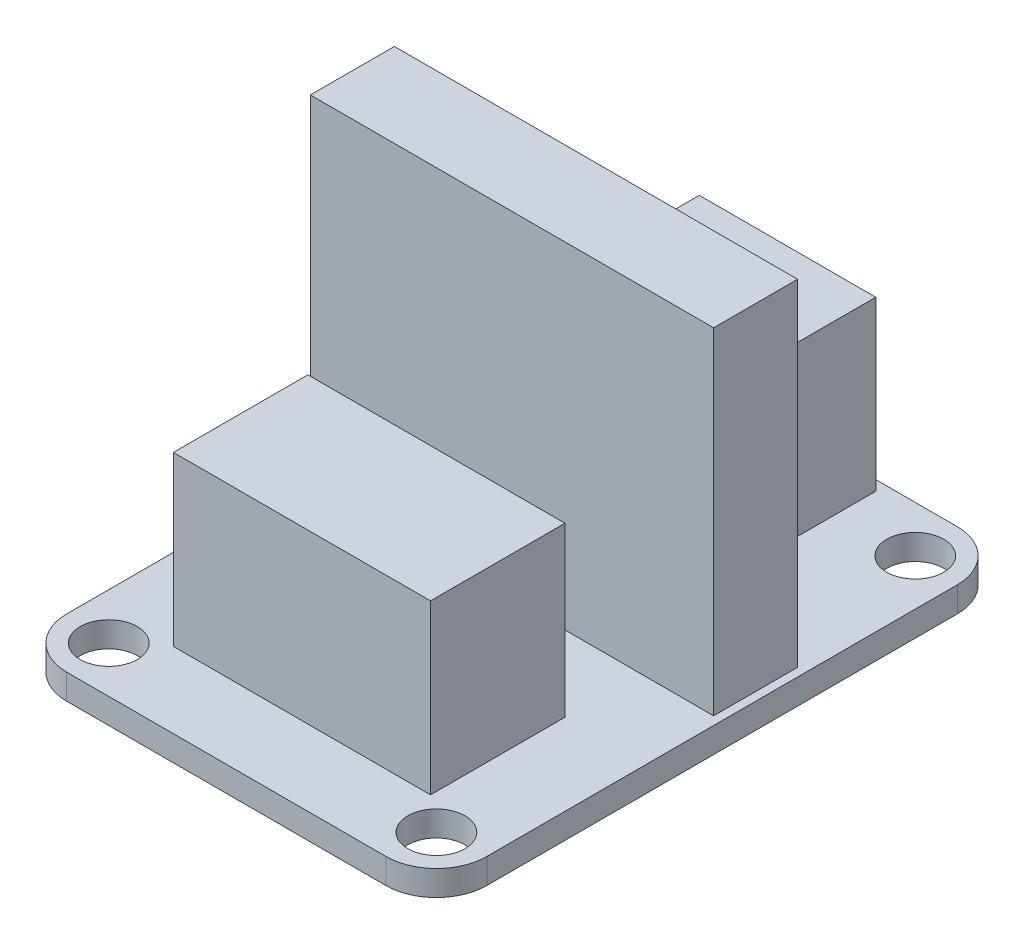
ISO-10303-21;
HEADER;
FILE_DESCRIPTION(('STEP AP214'),'2;1');
FILE_NAME('part.step','',(''),(''),'','','');
FILE_SCHEMA(('AUTOMOTIVE_DESIGN { 1 0 10303 214 1 1 1 1 }'));
ENDSEC;
DATA;
#1=APPLICATION_CONTEXT('core data for automotive mechanical design processes');
#2=APPLICATION_PROTOCOL_DEFINITION('international standard','automotive_design',2000,#1);
#3=PRODUCT_CONTEXT('',#1,'mechanical');
#4=PRODUCT('Part','Part','',(#3));
#5=PRODUCT_RELATED_PRODUCT_CATEGORY('part','',(#4));
#6=PRODUCT_DEFINITION_FORMATION('','',#4);
#7=PRODUCT_DEFINITION_CONTEXT('part definition',#1,'design');
#8=PRODUCT_DEFINITION('design','',#6,#7);
#9=PRODUCT_DEFINITION_SHAPE('','',#8);
#10=(LENGTH_UNIT() NAMED_UNIT(*) SI_UNIT(.MILLI.,.METRE.));
#11=(NAMED_UNIT(*) PLANE_ANGLE_UNIT() SI_UNIT($,.RADIAN.));
#12=(NAMED_UNIT(*) SI_UNIT($,.STERADIAN.) SOLID_ANGLE_UNIT());
#13=UNCERTAINTY_MEASURE_WITH_UNIT(LENGTH_MEASURE(1.E-05),#10,'distance_accuracy_value','');
#14=(GEOMETRIC_REPRESENTATION_CONTEXT(3) GLOBAL_UNCERTAINTY_ASSIGNED_CONTEXT((#13)) GLOBAL_UNIT_ASSIGNED_CONTEXT((#10,
#11,#12)) REPRESENTATION_CONTEXT('',''));
#15=CARTESIAN_POINT('',(0.,0.,0.));
#16=DIRECTION('',(0.,0.,1.));
#17=DIRECTION('',(1.,0.,0.));
#18=AXIS2_PLACEMENT_3D('',#15,#16,#17);
#19=CARTESIAN_POINT('',(0.,1.5,0.));
#20=DIRECTION('',(0.,-1.,0.));
#21=DIRECTION('',(0.,0.,-1.));
#22=AXIS2_PLACEMENT_3D('',#19,#20,#21);
#23=PLANE('',#22);
#24=DIRECTION('',(0.,0.,1.));
#25=VECTOR('',#24,1.);
#26=CARTESIAN_POINT('',(-5.25,1.5,-8.4));
#27=LINE('',#26,#25);
#28=CARTESIAN_POINT('',(-5.25,1.5,-16.4));
#29=VERTEX_POINT('',#28);
#30=CARTESIAN_POINT('',(-5.25,1.5,-8.4));
#31=VERTEX_POINT('',#30);
#32=EDGE_CURVE('E203',#29,#31,#27,.T.);
#33=ORIENTED_EDGE('',*,*,#32,.F.);
#34=DIRECTION('',(-1.,0.,0.));
#35=VECTOR('',#34,1.);
#36=CARTESIAN_POINT('',(5.25,1.5,-16.4));
#37=LINE('',#36,#35);
#38=CARTESIAN_POINT('',(5.25,1.5,-16.4));
#39=VERTEX_POINT('',#38);
#40=EDGE_CURVE('E219',#39,#29,#37,.T.);
#41=ORIENTED_EDGE('',*,*,#40,.F.);
#42=DIRECTION('',(0.,0.,-1.));
#43=VECTOR('',#42,1.);
#44=CARTESIAN_POINT('',(5.25,1.5,-8.4));
#45=LINE('',#44,#43);
#46=CARTESIAN_POINT('',(5.25,1.5,-8.4));
#47=VERTEX_POINT('',#46);
#48=EDGE_CURVE('E232',#47,#39,#45,.T.);
#49=ORIENTED_EDGE('',*,*,#48,.F.);
#50=DIRECTION('',(1.,0.,0.));
#51=VECTOR('',#50,1.);
#52=CARTESIAN_POINT('',(5.25,1.5,-8.4));
#53=LINE('',#52,#51);
#54=EDGE_CURVE('E208',#31,#47,#53,.T.);
#55=ORIENTED_EDGE('',*,*,#54,.F.);
#56=EDGE_LOOP('',(#33,#41,#49,#55));
#57=FACE_BOUND('',#56,.T.);
#58=DIRECTION('',(0.,0.,1.));
#59=VECTOR('',#58,1.);
#60=CARTESIAN_POINT('',(-12.5,1.5,17.));
#61=LINE('',#60,#59);
#62=CARTESIAN_POINT('',(-12.5,1.5,-14.));
#63=VERTEX_POINT('',#62);
#64=CARTESIAN_POINT('',(-12.5,1.5,14.));
#65=VERTEX_POINT('',#64);
#66=EDGE_CURVE('E341',#63,#65,#61,.T.);
#67=ORIENTED_EDGE('',*,*,#66,.T.);
#68=CARTESIAN_POINT('',(-9.5,1.5,14.));
#69=DIRECTION('',(0.,-1.,0.));
#70=DIRECTION('',(0.,0.,-1.));
#71=AXIS2_PLACEMENT_3D('',#68,#69,#70);
#72=CIRCLE('',#71,3.);
#73=CARTESIAN_POINT('',(-9.5,1.5,17.));
#74=VERTEX_POINT('',#73);
#75=EDGE_CURVE('E398',#65,#74,#72,.F.);
#76=ORIENTED_EDGE('',*,*,#75,.T.);
#77=DIRECTION('',(1.,0.,0.));
#78=VECTOR('',#77,1.);
#79=CARTESIAN_POINT('',(-12.5,1.5,17.));
#80=LINE('',#79,#78);
#81=CARTESIAN_POINT('',(9.5,1.5,17.));
#82=VERTEX_POINT('',#81);
#83=EDGE_CURVE('E345',#74,#82,#80,.T.);
#84=ORIENTED_EDGE('',*,*,#83,.T.);
#85=CARTESIAN_POINT('',(9.5,1.5,14.));
#86=DIRECTION('',(0.,-1.,0.));
#87=DIRECTION('',(0.,0.,-1.));
#88=AXIS2_PLACEMENT_3D('',#85,#86,#87);
#89=CIRCLE('',#88,3.);
#90=CARTESIAN_POINT('',(12.5,1.5,14.));
#91=VERTEX_POINT('',#90);
#92=EDGE_CURVE('E389',#82,#91,#89,.F.);
#93=ORIENTED_EDGE('',*,*,#92,.T.);
#94=DIRECTION('',(0.,0.,-1.));
#95=VECTOR('',#94,1.);
#96=CARTESIAN_POINT('',(12.5,1.5,17.));
#97=LINE('',#96,#95);
#98=CARTESIAN_POINT('',(12.5,1.5,-14.));
#99=VERTEX_POINT('',#98);
#100=EDGE_CURVE('E332',#91,#99,#97,.T.);
#101=ORIENTED_EDGE('',*,*,#100,.T.);
#102=CARTESIAN_POINT('',(9.5,1.5,-14.));
#103=DIRECTION('',(0.,-1.,0.));
#104=DIRECTION('',(0.,0.,-1.));
#105=AXIS2_PLACEMENT_3D('',#102,#103,#104);
#106=CIRCLE('',#105,3.);
#107=CARTESIAN_POINT('',(9.5,1.5,-17.));
#108=VERTEX_POINT('',#107);
#109=EDGE_CURVE('E392',#99,#108,#106,.F.);
#110=ORIENTED_EDGE('',*,*,#109,.T.);
#111=DIRECTION('',(-1.,0.,0.));
#112=VECTOR('',#111,1.);
#113=CARTESIAN_POINT('',(-12.5,1.5,-17.));
#114=LINE('',#113,#112);
#115=CARTESIAN_POINT('',(-9.5,1.5,-17.));
#116=VERTEX_POINT('',#115);
#117=EDGE_CURVE('E336',#108,#116,#114,.T.);
#118=ORIENTED_EDGE('',*,*,#117,.T.);
#119=CARTESIAN_POINT('',(-9.5,1.5,-14.));
#120=DIRECTION('',(0.,-1.,0.));
#121=DIRECTION('',(0.,0.,-1.));
#122=AXIS2_PLACEMENT_3D('',#119,#120,#121);
#123=CIRCLE('',#122,3.);
#124=EDGE_CURVE('E395',#116,#63,#123,.F.);
#125=ORIENTED_EDGE('',*,*,#124,.T.);
#126=EDGE_LOOP('',(#67,#76,#84,#93,#101,#110,#118,#125));
#127=FACE_BOUND('',#126,.T.);
#128=CARTESIAN_POINT('',(-9.75,1.5,14.25));
#129=DIRECTION('',(0.,1.,0.));
#130=DIRECTION('',(0.,0.,1.));
#131=AXIS2_PLACEMENT_3D('',#128,#129,#130);
#132=CIRCLE('',#131,1.69999999999999);
#133=CARTESIAN_POINT('',(-9.75,1.5,15.95));
#134=VERTEX_POINT('',#133);
#135=EDGE_CURVE('E323',#134,#134,#132,.T.);
#136=ORIENTED_EDGE('',*,*,#135,.F.);
#137=EDGE_LOOP('',(#136));
#138=FACE_BOUND('',#137,.T.);
#139=CARTESIAN_POINT('',(9.75,1.5,14.25));
#140=DIRECTION('',(0.,1.,0.));
#141=DIRECTION('',(0.,0.,1.));
#142=AXIS2_PLACEMENT_3D('',#139,#140,#141);
#143=CIRCLE('',#142,1.69999999999999);
#144=CARTESIAN_POINT('',(9.75,1.5,15.95));
#145=VERTEX_POINT('',#144);
#146=EDGE_CURVE('E315',#145,#145,#143,.T.);
#147=ORIENTED_EDGE('',*,*,#146,.F.);
#148=EDGE_LOOP('',(#147));
#149=FACE_BOUND('',#148,.T.);
#150=CARTESIAN_POINT('',(9.75,1.5,-14.25));
#151=DIRECTION('',(0.,1.,0.));
#152=DIRECTION('',(0.,0.,1.));
#153=AXIS2_PLACEMENT_3D('',#150,#151,#152);
#154=CIRCLE('',#153,1.69999999999999);
#155=CARTESIAN_POINT('',(9.75,1.5,-12.55));
#156=VERTEX_POINT('',#155);
#157=EDGE_CURVE('E307',#156,#156,#154,.T.);
#158=ORIENTED_EDGE('',*,*,#157,.F.);
#159=EDGE_LOOP('',(#158));
#160=FACE_BOUND('',#159,.T.);
#161=CARTESIAN_POINT('',(-9.75,1.5,-14.25));
#162=DIRECTION('',(0.,1.,0.));
#163=DIRECTION('',(0.,0.,1.));
#164=AXIS2_PLACEMENT_3D('',#161,#162,#163);
#165=CIRCLE('',#164,1.69999999999999);
#166=CARTESIAN_POINT('',(-9.75,1.5,-12.55));
#167=VERTEX_POINT('',#166);
#168=EDGE_CURVE('E299',#167,#167,#165,.T.);
#169=ORIENTED_EDGE('',*,*,#168,.F.);
#170=EDGE_LOOP('',(#169));
#171=FACE_BOUND('',#170,.T.);
#172=DIRECTION('',(0.,0.,1.));
#173=VECTOR('',#172,1.);
#174=CARTESIAN_POINT('',(-12.,1.5,0.));
#175=LINE('',#174,#173);
#176=CARTESIAN_POINT('',(-12.,1.5,-4.99999999999999));
#177=VERTEX_POINT('',#176);
#178=CARTESIAN_POINT('',(-12.,1.5,0.));
#179=VERTEX_POINT('',#178);
#180=EDGE_CURVE('E254',#177,#179,#175,.T.);
#181=ORIENTED_EDGE('',*,*,#180,.F.);
#182=DIRECTION('',(-1.,0.,0.));
#183=VECTOR('',#182,1.);
#184=CARTESIAN_POINT('',(12.,1.5,-5.));
#185=LINE('',#184,#183);
#186=CARTESIAN_POINT('',(12.,1.5,-5.));
#187=VERTEX_POINT('',#186);
#188=EDGE_CURVE('E260',#187,#177,#185,.T.);
#189=ORIENTED_EDGE('',*,*,#188,.F.);
#190=DIRECTION('',(0.,0.,-1.));
#191=VECTOR('',#190,1.);
#192=CARTESIAN_POINT('',(12.,1.5,0.));
#193=LINE('',#192,#191);
#194=CARTESIAN_POINT('',(12.,1.5,0.));
#195=VERTEX_POINT('',#194);
#196=EDGE_CURVE('E277',#195,#187,#193,.T.);
#197=ORIENTED_EDGE('',*,*,#196,.F.);
#198=DIRECTION('',(1.,0.,0.));
#199=VECTOR('',#198,1.);
#200=CARTESIAN_POINT('',(12.,1.5,0.));
#201=LINE('',#200,#199);
#202=EDGE_CURVE('E273',#179,#195,#201,.T.);
#203=ORIENTED_EDGE('',*,*,#202,.F.);
#204=EDGE_LOOP('',(#181,#189,#197,#203));
#205=FACE_BOUND('',#204,.T.);
#206=DIRECTION('',(0.,0.,1.));
#207=VECTOR('',#206,1.);
#208=CARTESIAN_POINT('',(-7.65,1.5,12.5));
#209=LINE('',#208,#207);
#210=CARTESIAN_POINT('',(-7.65,1.5,4.5));
#211=VERTEX_POINT('',#210);
#212=CARTESIAN_POINT('',(-7.65,1.5,12.5));
#213=VERTEX_POINT('',#212);
#214=EDGE_CURVE('E201',#211,#213,#209,.T.);
#215=ORIENTED_EDGE('',*,*,#214,.F.);
#216=DIRECTION('',(-1.,0.,0.));
#217=VECTOR('',#216,1.);
#218=CARTESIAN_POINT('',(7.65,1.5,4.5));
#219=LINE('',#218,#217);
#220=CARTESIAN_POINT('',(7.65,1.5,4.5));
#221=VERTEX_POINT('',#220);
#222=EDGE_CURVE('E198',#221,#211,#219,.T.);
#223=ORIENTED_EDGE('',*,*,#222,.F.);
#224=DIRECTION('',(0.,0.,-1.));
#225=VECTOR('',#224,1.);
#226=CARTESIAN_POINT('',(7.65,1.5,12.5));
#227=LINE('',#226,#225);
#228=CARTESIAN_POINT('',(7.65,1.5,12.5));
#229=VERTEX_POINT('',#228);
#230=EDGE_CURVE('E62',#229,#221,#227,.T.);
#231=ORIENTED_EDGE('',*,*,#230,.F.);
#232=DIRECTION('',(1.,0.,0.));
#233=VECTOR('',#232,1.);
#234=CARTESIAN_POINT('',(7.65,1.5,12.5));
#235=LINE('',#234,#233);
#236=EDGE_CURVE('E57',#213,#229,#235,.T.);
#237=ORIENTED_EDGE('',*,*,#236,.F.);
#238=EDGE_LOOP('',(#215,#223,#231,#237));
#239=FACE_BOUND('',#238,.T.);
#240=ADVANCED_FACE('F41',(#57,#127,#138,#149,#160,#171,#205,#239),#23,.F.);
#241=CARTESIAN_POINT('',(12.5,1.5,17.));
#242=DIRECTION('',(-1.,0.,0.));
#243=DIRECTION('',(0.,0.,1.));
#244=AXIS2_PLACEMENT_3D('',#241,#242,#243);
#245=PLANE('',#244);
#246=DIRECTION('',(0.,0.,-1.));
#247=VECTOR('',#246,1.);
#248=CARTESIAN_POINT('',(12.5,0.,17.));
#249=LINE('',#248,#247);
#250=CARTESIAN_POINT('',(12.5,0.,14.));
#251=VERTEX_POINT('',#250);
#252=CARTESIAN_POINT('',(12.5,0.,-14.));
#253=VERTEX_POINT('',#252);
#254=EDGE_CURVE('E331',#251,#253,#249,.T.);
#255=ORIENTED_EDGE('',*,*,#254,.T.);
#256=DIRECTION('',(0.,-1.,0.));
#257=VECTOR('',#256,1.);
#258=CARTESIAN_POINT('',(12.5,1.5,-14.));
#259=LINE('',#258,#257);
#260=EDGE_CURVE('E11',#253,#99,#259,.F.);
#261=ORIENTED_EDGE('',*,*,#260,.T.);
#262=ORIENTED_EDGE('',*,*,#100,.F.);
#263=DIRECTION('',(0.,-1.,0.));
#264=VECTOR('',#263,1.);
#265=CARTESIAN_POINT('',(12.5,1.5,14.));
#266=LINE('',#265,#264);
#267=EDGE_CURVE('E50',#91,#251,#266,.T.);
#268=ORIENTED_EDGE('',*,*,#267,.T.);
#269=EDGE_LOOP('',(#255,#261,#262,#268));
#270=FACE_BOUND('',#269,.T.);
#271=ADVANCED_FACE('F413',(#270),#245,.F.);
#272=CARTESIAN_POINT('',(-12.5,1.5,-17.));
#273=DIRECTION('',(0.,0.,1.));
#274=DIRECTION('',(1.,0.,0.));
#275=AXIS2_PLACEMENT_3D('',#272,#273,#274);
#276=PLANE('',#275);
#277=DIRECTION('',(-1.,0.,0.));
#278=VECTOR('',#277,1.);
#279=CARTESIAN_POINT('',(-12.5,0.,-17.));
#280=LINE('',#279,#278);
#281=CARTESIAN_POINT('',(9.5,0.,-17.));
#282=VERTEX_POINT('',#281);
#283=CARTESIAN_POINT('',(-9.5,0.,-17.));
#284=VERTEX_POINT('',#283);
#285=EDGE_CURVE('E353',#282,#284,#280,.T.);
#286=ORIENTED_EDGE('',*,*,#285,.T.);
#287=DIRECTION('',(0.,-1.,0.));
#288=VECTOR('',#287,1.);
#289=CARTESIAN_POINT('',(-9.5,1.5,-17.));
#290=LINE('',#289,#288);
#291=EDGE_CURVE('E405',#284,#116,#290,.F.);
#292=ORIENTED_EDGE('',*,*,#291,.T.);
#293=ORIENTED_EDGE('',*,*,#117,.F.);
#294=DIRECTION('',(0.,-1.,0.));
#295=VECTOR('',#294,1.);
#296=CARTESIAN_POINT('',(9.5,1.5,-17.));
#297=LINE('',#296,#295);
#298=EDGE_CURVE('E401',#108,#282,#297,.T.);
#299=ORIENTED_EDGE('',*,*,#298,.T.);
#300=EDGE_LOOP('',(#286,#292,#293,#299));
#301=FACE_BOUND('',#300,.T.);
#302=ADVANCED_FACE('F427',(#301),#276,.F.);
#303=CARTESIAN_POINT('',(-12.5,1.5,17.));
#304=DIRECTION('',(1.,0.,0.));
#305=DIRECTION('',(0.,0.,-1.));
#306=AXIS2_PLACEMENT_3D('',#303,#304,#305);
#307=PLANE('',#306);
#308=DIRECTION('',(0.,0.,1.));
#309=VECTOR('',#308,1.);
#310=CARTESIAN_POINT('',(-12.5,0.,17.));
#311=LINE('',#310,#309);
#312=CARTESIAN_POINT('',(-12.5,0.,-14.));
#313=VERTEX_POINT('',#312);
#314=CARTESIAN_POINT('',(-12.5,0.,14.));
#315=VERTEX_POINT('',#314);
#316=EDGE_CURVE('E357',#313,#315,#311,.T.);
#317=ORIENTED_EDGE('',*,*,#316,.T.);
#318=DIRECTION('',(0.,-1.,0.));
#319=VECTOR('',#318,1.);
#320=CARTESIAN_POINT('',(-12.5,1.5,14.));
#321=LINE('',#320,#319);
#322=EDGE_CURVE('E386',#315,#65,#321,.F.);
#323=ORIENTED_EDGE('',*,*,#322,.T.);
#324=ORIENTED_EDGE('',*,*,#66,.F.);
#325=DIRECTION('',(0.,-1.,0.));
#326=VECTOR('',#325,1.);
#327=CARTESIAN_POINT('',(-12.5,1.5,-14.));
#328=LINE('',#327,#326);
#329=EDGE_CURVE('E382',#63,#313,#328,.T.);
#330=ORIENTED_EDGE('',*,*,#329,.T.);
#331=EDGE_LOOP('',(#317,#323,#324,#330));
#332=FACE_BOUND('',#331,.T.);
#333=ADVANCED_FACE('F438',(#332),#307,.F.);
#334=CARTESIAN_POINT('',(-12.5,1.5,17.));
#335=DIRECTION('',(0.,0.,-1.));
#336=DIRECTION('',(-1.,0.,0.));
#337=AXIS2_PLACEMENT_3D('',#334,#335,#336);
#338=PLANE('',#337);
#339=ORIENTED_EDGE('',*,*,#83,.F.);
#340=DIRECTION('',(0.,-1.,0.));
#341=VECTOR('',#340,1.);
#342=CARTESIAN_POINT('',(-9.5,1.5,17.));
#343=LINE('',#342,#341);
#344=CARTESIAN_POINT('',(-9.5,0.,17.));
#345=VERTEX_POINT('',#344);
#346=EDGE_CURVE('E366',#74,#345,#343,.T.);
#347=ORIENTED_EDGE('',*,*,#346,.T.);
#348=DIRECTION('',(1.,0.,0.));
#349=VECTOR('',#348,1.);
#350=CARTESIAN_POINT('',(-12.5,0.,17.));
#351=LINE('',#350,#349);
#352=CARTESIAN_POINT('',(9.5,0.,17.));
#353=VERTEX_POINT('',#352);
#354=EDGE_CURVE('E337',#345,#353,#351,.T.);
#355=ORIENTED_EDGE('',*,*,#354,.T.);
#356=DIRECTION('',(0.,-1.,0.));
#357=VECTOR('',#356,1.);
#358=CARTESIAN_POINT('',(9.5,1.5,17.));
#359=LINE('',#358,#357);
#360=EDGE_CURVE('E349',#353,#82,#359,.F.);
#361=ORIENTED_EDGE('',*,*,#360,.T.);
#362=EDGE_LOOP('',(#339,#347,#355,#361));
#363=FACE_BOUND('',#362,.T.);
#364=ADVANCED_FACE('F446',(#363),#338,.F.);
#365=CARTESIAN_POINT('',(0.,0.,0.));
#366=DIRECTION('',(0.,-1.,0.));
#367=DIRECTION('',(0.,0.,-1.));
#368=AXIS2_PLACEMENT_3D('',#365,#366,#367);
#369=PLANE('',#368);
#370=CARTESIAN_POINT('',(-9.75,0.,-14.25));
#371=DIRECTION('',(0.,1.,0.));
#372=DIRECTION('',(0.,0.,1.));
#373=AXIS2_PLACEMENT_3D('',#370,#371,#372);
#374=CIRCLE('',#373,1.7);
#375=CARTESIAN_POINT('',(-9.75,0.,-12.55));
#376=VERTEX_POINT('',#375);
#377=EDGE_CURVE('E303',#376,#376,#374,.T.);
#378=ORIENTED_EDGE('',*,*,#377,.T.);
#379=EDGE_LOOP('',(#378));
#380=FACE_BOUND('',#379,.T.);
#381=CARTESIAN_POINT('',(9.75,0.,-14.25));
#382=DIRECTION('',(0.,1.,0.));
#383=DIRECTION('',(0.,0.,1.));
#384=AXIS2_PLACEMENT_3D('',#381,#382,#383);
#385=CIRCLE('',#384,1.7);
#386=CARTESIAN_POINT('',(9.75,0.,-12.55));
#387=VERTEX_POINT('',#386);
#388=EDGE_CURVE('E311',#387,#387,#385,.T.);
#389=ORIENTED_EDGE('',*,*,#388,.T.);
#390=EDGE_LOOP('',(#389));
#391=FACE_BOUND('',#390,.T.);
#392=CARTESIAN_POINT('',(9.75,0.,14.25));
#393=DIRECTION('',(0.,1.,0.));
#394=DIRECTION('',(0.,0.,1.));
#395=AXIS2_PLACEMENT_3D('',#392,#393,#394);
#396=CIRCLE('',#395,1.7);
#397=CARTESIAN_POINT('',(9.75,0.,15.95));
#398=VERTEX_POINT('',#397);
#399=EDGE_CURVE('E319',#398,#398,#396,.T.);
#400=ORIENTED_EDGE('',*,*,#399,.T.);
#401=EDGE_LOOP('',(#400));
#402=FACE_BOUND('',#401,.T.);
#403=CARTESIAN_POINT('',(-9.75,0.,14.25));
#404=DIRECTION('',(0.,1.,0.));
#405=DIRECTION('',(0.,0.,1.));
#406=AXIS2_PLACEMENT_3D('',#403,#404,#405);
#407=CIRCLE('',#406,1.7);
#408=CARTESIAN_POINT('',(-9.75,0.,15.95));
#409=VERTEX_POINT('',#408);
#410=EDGE_CURVE('E327',#409,#409,#407,.T.);
#411=ORIENTED_EDGE('',*,*,#410,.T.);
#412=EDGE_LOOP('',(#411));
#413=FACE_BOUND('',#412,.T.);
#414=ORIENTED_EDGE('',*,*,#354,.F.);
#415=CARTESIAN_POINT('',(-9.5,0.,14.));
#416=DIRECTION('',(0.,-1.,0.));
#417=DIRECTION('',(0.,0.,-1.));
#418=AXIS2_PLACEMENT_3D('',#415,#416,#417);
#419=CIRCLE('',#418,3.);
#420=EDGE_CURVE('E379',#345,#315,#419,.T.);
#421=ORIENTED_EDGE('',*,*,#420,.T.);
#422=ORIENTED_EDGE('',*,*,#316,.F.);
#423=CARTESIAN_POINT('',(-9.5,0.,-14.));
#424=DIRECTION('',(0.,-1.,0.));
#425=DIRECTION('',(0.,0.,-1.));
#426=AXIS2_PLACEMENT_3D('',#423,#424,#425);
#427=CIRCLE('',#426,3.);
#428=EDGE_CURVE('E376',#313,#284,#427,.T.);
#429=ORIENTED_EDGE('',*,*,#428,.T.);
#430=ORIENTED_EDGE('',*,*,#285,.F.);
#431=CARTESIAN_POINT('',(9.5,0.,-14.));
#432=DIRECTION('',(0.,-1.,0.));
#433=DIRECTION('',(0.,0.,-1.));
#434=AXIS2_PLACEMENT_3D('',#431,#432,#433);
#435=CIRCLE('',#434,3.);
#436=EDGE_CURVE('E373',#282,#253,#435,.T.);
#437=ORIENTED_EDGE('',*,*,#436,.T.);
#438=ORIENTED_EDGE('',*,*,#254,.F.);
#439=CARTESIAN_POINT('',(9.5,0.,14.));
#440=DIRECTION('',(0.,-1.,0.));
#441=DIRECTION('',(0.,0.,-1.));
#442=AXIS2_PLACEMENT_3D('',#439,#440,#441);
#443=CIRCLE('',#442,3.);
#444=EDGE_CURVE('E370',#251,#353,#443,.T.);
#445=ORIENTED_EDGE('',*,*,#444,.T.);
#446=EDGE_LOOP('',(#414,#421,#422,#429,#430,#437,#438,#445));
#447=FACE_BOUND('',#446,.T.);
#448=ADVANCED_FACE('F419',(#380,#391,#402,#413,#447),#369,.T.);
#449=CARTESIAN_POINT('',(-9.5,1.5,14.));
#450=DIRECTION('',(0.,-1.,0.));
#451=DIRECTION('',(0.,0.,-1.));
#452=AXIS2_PLACEMENT_3D('',#449,#450,#451);
#453=CYLINDRICAL_SURFACE('',#452,3.);
#454=ORIENTED_EDGE('',*,*,#75,.F.);
#455=ORIENTED_EDGE('',*,*,#322,.F.);
#456=ORIENTED_EDGE('',*,*,#420,.F.);
#457=ORIENTED_EDGE('',*,*,#346,.F.);
#458=EDGE_LOOP('',(#454,#455,#456,#457));
#459=FACE_BOUND('',#458,.T.);
#460=ADVANCED_FACE('F443',(#459),#453,.T.);
#461=CARTESIAN_POINT('',(-9.5,1.5,-14.));
#462=DIRECTION('',(0.,-1.,0.));
#463=DIRECTION('',(0.,0.,-1.));
#464=AXIS2_PLACEMENT_3D('',#461,#462,#463);
#465=CYLINDRICAL_SURFACE('',#464,3.);
#466=ORIENTED_EDGE('',*,*,#124,.F.);
#467=ORIENTED_EDGE('',*,*,#291,.F.);
#468=ORIENTED_EDGE('',*,*,#428,.F.);
#469=ORIENTED_EDGE('',*,*,#329,.F.);
#470=EDGE_LOOP('',(#466,#467,#468,#469));
#471=FACE_BOUND('',#470,.T.);
#472=ADVANCED_FACE('F435',(#471),#465,.T.);
#473=CARTESIAN_POINT('',(9.5,1.5,-14.));
#474=DIRECTION('',(0.,-1.,0.));
#475=DIRECTION('',(0.,0.,-1.));
#476=AXIS2_PLACEMENT_3D('',#473,#474,#475);
#477=CYLINDRICAL_SURFACE('',#476,3.);
#478=ORIENTED_EDGE('',*,*,#109,.F.);
#479=ORIENTED_EDGE('',*,*,#260,.F.);
#480=ORIENTED_EDGE('',*,*,#436,.F.);
#481=ORIENTED_EDGE('',*,*,#298,.F.);
#482=EDGE_LOOP('',(#478,#479,#480,#481));
#483=FACE_BOUND('',#482,.T.);
#484=ADVANCED_FACE('F424',(#483),#477,.T.);
#485=CARTESIAN_POINT('',(9.5,1.5,14.));
#486=DIRECTION('',(0.,-1.,0.));
#487=DIRECTION('',(0.,0.,-1.));
#488=AXIS2_PLACEMENT_3D('',#485,#486,#487);
#489=CYLINDRICAL_SURFACE('',#488,3.);
#490=ORIENTED_EDGE('',*,*,#92,.F.);
#491=ORIENTED_EDGE('',*,*,#360,.F.);
#492=ORIENTED_EDGE('',*,*,#444,.F.);
#493=ORIENTED_EDGE('',*,*,#267,.F.);
#494=EDGE_LOOP('',(#490,#491,#492,#493));
#495=FACE_BOUND('',#494,.T.);
#496=ADVANCED_FACE('F43',(#495),#489,.T.);
#497=CARTESIAN_POINT('',(-9.75,1.5,14.25));
#498=DIRECTION('',(0.,1.,0.));
#499=DIRECTION('',(0.,0.,1.));
#500=AXIS2_PLACEMENT_3D('',#497,#498,#499);
#501=CYLINDRICAL_SURFACE('',#500,1.69999999999999);
#502=ORIENTED_EDGE('',*,*,#410,.F.);
#503=EDGE_LOOP('',(#502));
#504=FACE_BOUND('',#503,.T.);
#505=ORIENTED_EDGE('',*,*,#135,.T.);
#506=EDGE_LOOP('',(#505));
#507=FACE_BOUND('',#506,.T.);
#508=ADVANCED_FACE('F449',(#504,#507),#501,.F.);
#509=CARTESIAN_POINT('',(9.75,1.5,14.25));
#510=DIRECTION('',(0.,1.,0.));
#511=DIRECTION('',(0.,0.,1.));
#512=AXIS2_PLACEMENT_3D('',#509,#510,#511);
#513=CYLINDRICAL_SURFACE('',#512,1.69999999999999);
#514=ORIENTED_EDGE('',*,*,#399,.F.);
#515=EDGE_LOOP('',(#514));
#516=FACE_BOUND('',#515,.T.);
#517=ORIENTED_EDGE('',*,*,#146,.T.);
#518=EDGE_LOOP('',(#517));
#519=FACE_BOUND('',#518,.T.);
#520=ADVANCED_FACE('F454',(#516,#519),#513,.F.);
#521=CARTESIAN_POINT('',(9.75,1.5,-14.25));
#522=DIRECTION('',(0.,1.,0.));
#523=DIRECTION('',(0.,0.,1.));
#524=AXIS2_PLACEMENT_3D('',#521,#522,#523);
#525=CYLINDRICAL_SURFACE('',#524,1.69999999999999);
#526=ORIENTED_EDGE('',*,*,#388,.F.);
#527=EDGE_LOOP('',(#526));
#528=FACE_BOUND('',#527,.T.);
#529=ORIENTED_EDGE('',*,*,#157,.T.);
#530=EDGE_LOOP('',(#529));
#531=FACE_BOUND('',#530,.T.);
#532=ADVANCED_FACE('F513',(#528,#531),#525,.F.);
#533=CARTESIAN_POINT('',(-9.75,1.5,-14.25));
#534=DIRECTION('',(0.,1.,0.));
#535=DIRECTION('',(0.,0.,1.));
#536=AXIS2_PLACEMENT_3D('',#533,#534,#535);
#537=CYLINDRICAL_SURFACE('',#536,1.69999999999999);
#538=ORIENTED_EDGE('',*,*,#377,.F.);
#539=EDGE_LOOP('',(#538));
#540=FACE_BOUND('',#539,.T.);
#541=ORIENTED_EDGE('',*,*,#168,.T.);
#542=EDGE_LOOP('',(#541));
#543=FACE_BOUND('',#542,.T.);
#544=ADVANCED_FACE('F522',(#540,#543),#537,.F.);
#545=CARTESIAN_POINT('',(-12.,21.5,0.));
#546=DIRECTION('',(1.,0.,0.));
#547=DIRECTION('',(0.,0.,-1.));
#548=AXIS2_PLACEMENT_3D('',#545,#546,#547);
#549=PLANE('',#548);
#550=ORIENTED_EDGE('',*,*,#180,.T.);
#551=DIRECTION('',(0.,-1.,0.));
#552=VECTOR('',#551,1.);
#553=CARTESIAN_POINT('',(-12.,21.5,0.));
#554=LINE('',#553,#552);
#555=CARTESIAN_POINT('',(-12.,21.5,0.));
#556=VERTEX_POINT('',#555);
#557=EDGE_CURVE('E295',#556,#179,#554,.T.);
#558=ORIENTED_EDGE('',*,*,#557,.F.);
#559=DIRECTION('',(0.,0.,1.));
#560=VECTOR('',#559,1.);
#561=CARTESIAN_POINT('',(-12.,21.5,0.));
#562=LINE('',#561,#560);
#563=CARTESIAN_POINT('',(-12.,21.5,-4.99999999999999));
#564=VERTEX_POINT('',#563);
#565=EDGE_CURVE('E255',#564,#556,#562,.T.);
#566=ORIENTED_EDGE('',*,*,#565,.F.);
#567=DIRECTION('',(0.,-1.,0.));
#568=VECTOR('',#567,1.);
#569=CARTESIAN_POINT('',(-12.,21.5,-4.99999999999999));
#570=LINE('',#569,#568);
#571=EDGE_CURVE('E269',#564,#177,#570,.T.);
#572=ORIENTED_EDGE('',*,*,#571,.T.);
#573=EDGE_LOOP('',(#550,#558,#566,#572));
#574=FACE_BOUND('',#573,.T.);
#575=ADVANCED_FACE('F532',(#574),#549,.F.);
#576=CARTESIAN_POINT('',(12.,21.5,0.));
#577=DIRECTION('',(0.,0.,-1.));
#578=DIRECTION('',(-1.,0.,0.));
#579=AXIS2_PLACEMENT_3D('',#576,#577,#578);
#580=PLANE('',#579);
#581=ORIENTED_EDGE('',*,*,#202,.T.);
#582=DIRECTION('',(0.,-1.,0.));
#583=VECTOR('',#582,1.);
#584=CARTESIAN_POINT('',(12.,21.5,0.));
#585=LINE('',#584,#583);
#586=CARTESIAN_POINT('',(12.,21.5,0.));
#587=VERTEX_POINT('',#586);
#588=EDGE_CURVE('E291',#587,#195,#585,.T.);
#589=ORIENTED_EDGE('',*,*,#588,.F.);
#590=DIRECTION('',(1.,0.,0.));
#591=VECTOR('',#590,1.);
#592=CARTESIAN_POINT('',(12.,21.5,0.));
#593=LINE('',#592,#591);
#594=EDGE_CURVE('E259',#556,#587,#593,.T.);
#595=ORIENTED_EDGE('',*,*,#594,.F.);
#596=ORIENTED_EDGE('',*,*,#557,.T.);
#597=EDGE_LOOP('',(#581,#589,#595,#596));
#598=FACE_BOUND('',#597,.T.);
#599=ADVANCED_FACE('F542',(#598),#580,.F.);
#600=CARTESIAN_POINT('',(12.,21.5,0.));
#601=DIRECTION('',(-1.,0.,0.));
#602=DIRECTION('',(0.,0.,1.));
#603=AXIS2_PLACEMENT_3D('',#600,#601,#602);
#604=PLANE('',#603);
#605=ORIENTED_EDGE('',*,*,#196,.T.);
#606=DIRECTION('',(0.,-1.,0.));
#607=VECTOR('',#606,1.);
#608=CARTESIAN_POINT('',(12.,21.5,-5.));
#609=LINE('',#608,#607);
#610=CARTESIAN_POINT('',(12.,21.5,-5.));
#611=VERTEX_POINT('',#610);
#612=EDGE_CURVE('E287',#611,#187,#609,.T.);
#613=ORIENTED_EDGE('',*,*,#612,.F.);
#614=DIRECTION('',(0.,0.,-1.));
#615=VECTOR('',#614,1.);
#616=CARTESIAN_POINT('',(12.,21.5,0.));
#617=LINE('',#616,#615);
#618=EDGE_CURVE('E263',#587,#611,#617,.T.);
#619=ORIENTED_EDGE('',*,*,#618,.F.);
#620=ORIENTED_EDGE('',*,*,#588,.T.);
#621=EDGE_LOOP('',(#605,#613,#619,#620));
#622=FACE_BOUND('',#621,.T.);
#623=ADVANCED_FACE('F552',(#622),#604,.F.);
#624=CARTESIAN_POINT('',(12.,21.5,-5.));
#625=DIRECTION('',(0.,0.,1.));
#626=DIRECTION('',(1.,0.,0.));
#627=AXIS2_PLACEMENT_3D('',#624,#625,#626);
#628=PLANE('',#627);
#629=ORIENTED_EDGE('',*,*,#188,.T.);
#630=ORIENTED_EDGE('',*,*,#571,.F.);
#631=DIRECTION('',(-1.,0.,0.));
#632=VECTOR('',#631,1.);
#633=CARTESIAN_POINT('',(12.,21.5,-5.));
#634=LINE('',#633,#632);
#635=EDGE_CURVE('E266',#611,#564,#634,.T.);
#636=ORIENTED_EDGE('',*,*,#635,.F.);
#637=ORIENTED_EDGE('',*,*,#612,.T.);
#638=EDGE_LOOP('',(#629,#630,#636,#637));
#639=FACE_BOUND('',#638,.T.);
#640=ADVANCED_FACE('F562',(#639),#628,.F.);
#641=CARTESIAN_POINT('',(0.,21.5,0.));
#642=DIRECTION('',(0.,1.,0.));
#643=DIRECTION('',(0.,0.,1.));
#644=AXIS2_PLACEMENT_3D('',#641,#642,#643);
#645=PLANE('',#644);
#646=ORIENTED_EDGE('',*,*,#565,.T.);
#647=ORIENTED_EDGE('',*,*,#594,.T.);
#648=ORIENTED_EDGE('',*,*,#618,.T.);
#649=ORIENTED_EDGE('',*,*,#635,.T.);
#650=EDGE_LOOP('',(#646,#647,#648,#649));
#651=FACE_BOUND('',#650,.T.);
#652=ADVANCED_FACE('F572',(#651),#645,.T.);
#653=CARTESIAN_POINT('',(-5.25,11.5,-8.4));
#654=DIRECTION('',(1.,0.,0.));
#655=DIRECTION('',(0.,0.,-1.));
#656=AXIS2_PLACEMENT_3D('',#653,#654,#655);
#657=PLANE('',#656);
#658=ORIENTED_EDGE('',*,*,#32,.T.);
#659=DIRECTION('',(0.,-1.,0.));
#660=VECTOR('',#659,1.);
#661=CARTESIAN_POINT('',(-5.25,11.5,-8.4));
#662=LINE('',#661,#660);
#663=CARTESIAN_POINT('',(-5.25,11.5,-8.4));
#664=VERTEX_POINT('',#663);
#665=EDGE_CURVE('E250',#664,#31,#662,.T.);
#666=ORIENTED_EDGE('',*,*,#665,.F.);
#667=DIRECTION('',(0.,0.,1.));
#668=VECTOR('',#667,1.);
#669=CARTESIAN_POINT('',(-5.25,11.5,-8.4));
#670=LINE('',#669,#668);
#671=CARTESIAN_POINT('',(-5.25,11.5,-16.4));
#672=VERTEX_POINT('',#671);
#673=EDGE_CURVE('E214',#672,#664,#670,.T.);
#674=ORIENTED_EDGE('',*,*,#673,.F.);
#675=DIRECTION('',(0.,-1.,0.));
#676=VECTOR('',#675,1.);
#677=CARTESIAN_POINT('',(-5.25,11.5,-16.4));
#678=LINE('',#677,#676);
#679=EDGE_CURVE('E227',#672,#29,#678,.T.);
#680=ORIENTED_EDGE('',*,*,#679,.T.);
#681=EDGE_LOOP('',(#658,#666,#674,#680));
#682=FACE_BOUND('',#681,.T.);
#683=ADVANCED_FACE('F581',(#682),#657,.F.);
#684=CARTESIAN_POINT('',(5.25,11.5,-8.4));
#685=DIRECTION('',(0.,0.,-1.));
#686=DIRECTION('',(-1.,0.,0.));
#687=AXIS2_PLACEMENT_3D('',#684,#685,#686);
#688=PLANE('',#687);
#689=ORIENTED_EDGE('',*,*,#54,.T.);
#690=DIRECTION('',(0.,-1.,0.));
#691=VECTOR('',#690,1.);
#692=CARTESIAN_POINT('',(5.25,11.5,-8.4));
#693=LINE('',#692,#691);
#694=CARTESIAN_POINT('',(5.25,11.5,-8.4));
#695=VERTEX_POINT('',#694);
#696=EDGE_CURVE('E246',#695,#47,#693,.T.);
#697=ORIENTED_EDGE('',*,*,#696,.F.);
#698=DIRECTION('',(1.,0.,0.));
#699=VECTOR('',#698,1.);
#700=CARTESIAN_POINT('',(5.25,11.5,-8.4));
#701=LINE('',#700,#699);
#702=EDGE_CURVE('E218',#664,#695,#701,.T.);
#703=ORIENTED_EDGE('',*,*,#702,.F.);
#704=ORIENTED_EDGE('',*,*,#665,.T.);
#705=EDGE_LOOP('',(#689,#697,#703,#704));
#706=FACE_BOUND('',#705,.T.);
#707=ADVANCED_FACE('F596',(#706),#688,.F.);
#708=CARTESIAN_POINT('',(5.25,11.5,-8.4));
#709=DIRECTION('',(-1.,0.,0.));
#710=DIRECTION('',(0.,0.,1.));
#711=AXIS2_PLACEMENT_3D('',#708,#709,#710);
#712=PLANE('',#711);
#713=ORIENTED_EDGE('',*,*,#48,.T.);
#714=DIRECTION('',(0.,-1.,0.));
#715=VECTOR('',#714,1.);
#716=CARTESIAN_POINT('',(5.25,11.5,-16.4));
#717=LINE('',#716,#715);
#718=CARTESIAN_POINT('',(5.25,11.5,-16.4));
#719=VERTEX_POINT('',#718);
#720=EDGE_CURVE('E242',#719,#39,#717,.T.);
#721=ORIENTED_EDGE('',*,*,#720,.F.);
#722=DIRECTION('',(0.,0.,-1.));
#723=VECTOR('',#722,1.);
#724=CARTESIAN_POINT('',(5.25,11.5,-8.4));
#725=LINE('',#724,#723);
#726=EDGE_CURVE('E222',#695,#719,#725,.T.);
#727=ORIENTED_EDGE('',*,*,#726,.F.);
#728=ORIENTED_EDGE('',*,*,#696,.T.);
#729=EDGE_LOOP('',(#713,#721,#727,#728));
#730=FACE_BOUND('',#729,.T.);
#731=ADVANCED_FACE('F606',(#730),#712,.F.);
#732=CARTESIAN_POINT('',(5.25,11.5,-16.4));
#733=DIRECTION('',(0.,0.,1.));
#734=DIRECTION('',(1.,0.,0.));
#735=AXIS2_PLACEMENT_3D('',#732,#733,#734);
#736=PLANE('',#735);
#737=ORIENTED_EDGE('',*,*,#40,.T.);
#738=ORIENTED_EDGE('',*,*,#679,.F.);
#739=DIRECTION('',(-1.,0.,0.));
#740=VECTOR('',#739,1.);
#741=CARTESIAN_POINT('',(5.25,11.5,-16.4));
#742=LINE('',#741,#740);
#743=EDGE_CURVE('E225',#719,#672,#742,.T.);
#744=ORIENTED_EDGE('',*,*,#743,.F.);
#745=ORIENTED_EDGE('',*,*,#720,.T.);
#746=EDGE_LOOP('',(#737,#738,#744,#745));
#747=FACE_BOUND('',#746,.T.);
#748=ADVANCED_FACE('F616',(#747),#736,.F.);
#749=CARTESIAN_POINT('',(0.,11.5,0.));
#750=DIRECTION('',(0.,1.,0.));
#751=DIRECTION('',(0.,0.,1.));
#752=AXIS2_PLACEMENT_3D('',#749,#750,#751);
#753=PLANE('',#752);
#754=ORIENTED_EDGE('',*,*,#673,.T.);
#755=ORIENTED_EDGE('',*,*,#702,.T.);
#756=ORIENTED_EDGE('',*,*,#726,.T.);
#757=ORIENTED_EDGE('',*,*,#743,.T.);
#758=EDGE_LOOP('',(#754,#755,#756,#757));
#759=FACE_BOUND('',#758,.T.);
#760=ADVANCED_FACE('F626',(#759),#753,.T.);
#761=CARTESIAN_POINT('',(-7.65,11.5,12.5));
#762=DIRECTION('',(1.,0.,0.));
#763=DIRECTION('',(0.,0.,-1.));
#764=AXIS2_PLACEMENT_3D('',#761,#762,#763);
#765=PLANE('',#764);
#766=ORIENTED_EDGE('',*,*,#214,.T.);
#767=DIRECTION('',(0.,-1.,0.));
#768=VECTOR('',#767,1.);
#769=CARTESIAN_POINT('',(-7.65,11.5,12.5));
#770=LINE('',#769,#768);
#771=CARTESIAN_POINT('',(-7.65,11.5,12.5));
#772=VERTEX_POINT('',#771);
#773=EDGE_CURVE('E180',#772,#213,#770,.T.);
#774=ORIENTED_EDGE('',*,*,#773,.F.);
#775=DIRECTION('',(0.,0.,1.));
#776=VECTOR('',#775,1.);
#777=CARTESIAN_POINT('',(-7.65,11.5,12.5));
#778=LINE('',#777,#776);
#779=CARTESIAN_POINT('',(-7.65,11.5,4.5));
#780=VERTEX_POINT('',#779);
#781=EDGE_CURVE('E188',#780,#772,#778,.T.);
#782=ORIENTED_EDGE('',*,*,#781,.F.);
#783=DIRECTION('',(0.,-1.,0.));
#784=VECTOR('',#783,1.);
#785=CARTESIAN_POINT('',(-7.65,11.5,4.5));
#786=LINE('',#785,#784);
#787=EDGE_CURVE('E686',#780,#211,#786,.T.);
#788=ORIENTED_EDGE('',*,*,#787,.T.);
#789=EDGE_LOOP('',(#766,#774,#782,#788));
#790=FACE_BOUND('',#789,.T.);
#791=ADVANCED_FACE('F200',(#790),#765,.F.);
#792=CARTESIAN_POINT('',(7.65,11.5,12.5));
#793=DIRECTION('',(0.,0.,-1.));
#794=DIRECTION('',(-1.,0.,0.));
#795=AXIS2_PLACEMENT_3D('',#792,#793,#794);
#796=PLANE('',#795);
#797=ORIENTED_EDGE('',*,*,#236,.T.);
#798=DIRECTION('',(0.,-1.,0.));
#799=VECTOR('',#798,1.);
#800=CARTESIAN_POINT('',(7.65,11.5,12.5));
#801=LINE('',#800,#799);
#802=CARTESIAN_POINT('',(7.65,11.5,12.5));
#803=VERTEX_POINT('',#802);
#804=EDGE_CURVE('E183',#803,#229,#801,.T.);
#805=ORIENTED_EDGE('',*,*,#804,.F.);
#806=DIRECTION('',(1.,0.,0.));
#807=VECTOR('',#806,1.);
#808=CARTESIAN_POINT('',(7.65,11.5,12.5));
#809=LINE('',#808,#807);
#810=EDGE_CURVE('E176',#772,#803,#809,.T.);
#811=ORIENTED_EDGE('',*,*,#810,.F.);
#812=ORIENTED_EDGE('',*,*,#773,.T.);
#813=EDGE_LOOP('',(#797,#805,#811,#812));
#814=FACE_BOUND('',#813,.T.);
#815=ADVANCED_FACE('F178',(#814),#796,.F.);
#816=CARTESIAN_POINT('',(7.65,11.5,12.5));
#817=DIRECTION('',(-1.,0.,0.));
#818=DIRECTION('',(0.,0.,1.));
#819=AXIS2_PLACEMENT_3D('',#816,#817,#818);
#820=PLANE('',#819);
#821=ORIENTED_EDGE('',*,*,#230,.T.);
#822=DIRECTION('',(0.,-1.,0.));
#823=VECTOR('',#822,1.);
#824=CARTESIAN_POINT('',(7.65,11.5,4.5));
#825=LINE('',#824,#823);
#826=CARTESIAN_POINT('',(7.65,11.5,4.5));
#827=VERTEX_POINT('',#826);
#828=EDGE_CURVE('E210',#827,#221,#825,.T.);
#829=ORIENTED_EDGE('',*,*,#828,.F.);
#830=DIRECTION('',(0.,0.,-1.));
#831=VECTOR('',#830,1.);
#832=CARTESIAN_POINT('',(7.65,11.5,12.5));
#833=LINE('',#832,#831);
#834=EDGE_CURVE('E187',#803,#827,#833,.T.);
#835=ORIENTED_EDGE('',*,*,#834,.F.);
#836=ORIENTED_EDGE('',*,*,#804,.T.);
#837=EDGE_LOOP('',(#821,#829,#835,#836));
#838=FACE_BOUND('',#837,.T.);
#839=ADVANCED_FACE('F653',(#838),#820,.F.);
#840=CARTESIAN_POINT('',(7.65,11.5,4.5));
#841=DIRECTION('',(0.,0.,1.));
#842=DIRECTION('',(1.,0.,0.));
#843=AXIS2_PLACEMENT_3D('',#840,#841,#842);
#844=PLANE('',#843);
#845=ORIENTED_EDGE('',*,*,#222,.T.);
#846=ORIENTED_EDGE('',*,*,#787,.F.);
#847=DIRECTION('',(-1.,0.,0.));
#848=VECTOR('',#847,1.);
#849=CARTESIAN_POINT('',(7.65,11.5,4.5));
#850=LINE('',#849,#848);
#851=EDGE_CURVE('E193',#827,#780,#850,.T.);
#852=ORIENTED_EDGE('',*,*,#851,.F.);
#853=ORIENTED_EDGE('',*,*,#828,.T.);
#854=EDGE_LOOP('',(#845,#846,#852,#853));
#855=FACE_BOUND('',#854,.T.);
#856=ADVANCED_FACE('F662',(#855),#844,.F.);
#857=CARTESIAN_POINT('',(0.,11.5,0.));
#858=DIRECTION('',(0.,1.,0.));
#859=DIRECTION('',(0.,0.,1.));
#860=AXIS2_PLACEMENT_3D('',#857,#858,#859);
#861=PLANE('',#860);
#862=ORIENTED_EDGE('',*,*,#781,.T.);
#863=ORIENTED_EDGE('',*,*,#810,.T.);
#864=ORIENTED_EDGE('',*,*,#834,.T.);
#865=ORIENTED_EDGE('',*,*,#851,.T.);
#866=EDGE_LOOP('',(#862,#863,#864,#865));
#867=FACE_BOUND('',#866,.T.);
#868=ADVANCED_FACE('F191',(#867),#861,.T.);
#869=CLOSED_SHELL('',(#240,#271,#302,#333,#364,#448,#460,#472,#484,#496,#508,#520,#532,#544,
#575,#599,#623,#640,#652,#683,#707,#731,#748,#760,#791,#815,#839,#856,#868));
#870=MANIFOLD_SOLID_BREP('B2',#869);
#871=ADVANCED_BREP_SHAPE_REPRESENTATION('',(#18,#870),#14);
#872=SHAPE_DEFINITION_REPRESENTATION(#9,#871);
ENDSEC;
END-ISO-10303-21;
